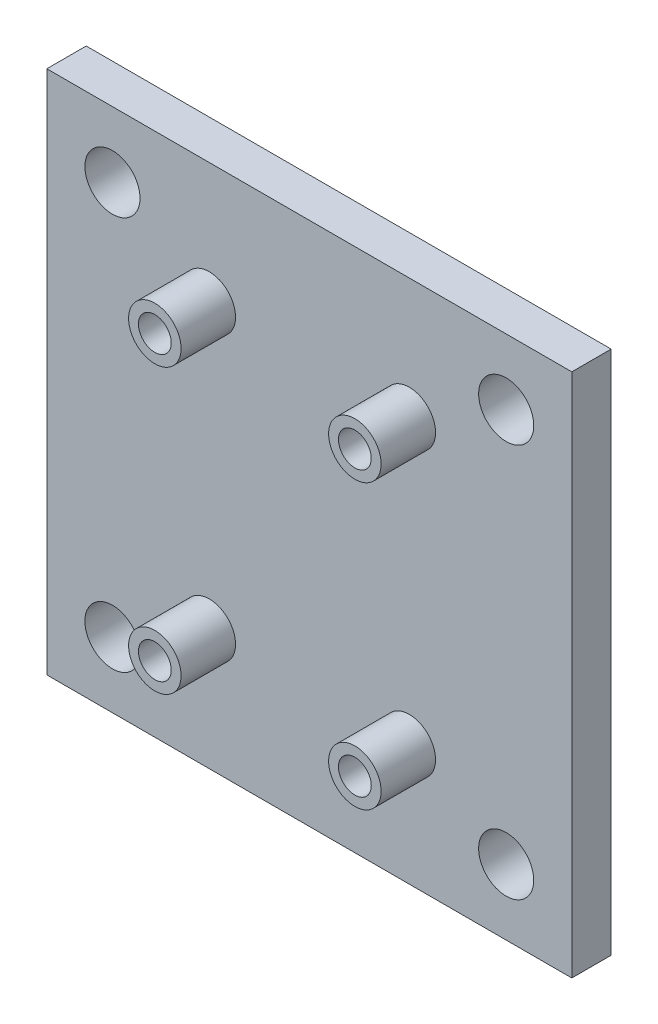
ISO-10303-21;
HEADER;
FILE_DESCRIPTION(('STEP AP214'),'2;1');
FILE_NAME('part.step','',(''),(''),'','','');
FILE_SCHEMA(('AUTOMOTIVE_DESIGN { 1 0 10303 214 1 1 1 1 }'));
ENDSEC;
DATA;
#1=APPLICATION_CONTEXT('core data for automotive mechanical design processes');
#2=APPLICATION_PROTOCOL_DEFINITION('international standard','automotive_design',2000,#1);
#3=PRODUCT_CONTEXT('',#1,'mechanical');
#4=PRODUCT('Part','Part','',(#3));
#5=PRODUCT_RELATED_PRODUCT_CATEGORY('part','',(#4));
#6=PRODUCT_DEFINITION_FORMATION('','',#4);
#7=PRODUCT_DEFINITION_CONTEXT('part definition',#1,'design');
#8=PRODUCT_DEFINITION('design','',#6,#7);
#9=PRODUCT_DEFINITION_SHAPE('','',#8);
#10=(LENGTH_UNIT() NAMED_UNIT(*) SI_UNIT(.MILLI.,.METRE.));
#11=(NAMED_UNIT(*) PLANE_ANGLE_UNIT() SI_UNIT($,.RADIAN.));
#12=(NAMED_UNIT(*) SI_UNIT($,.STERADIAN.) SOLID_ANGLE_UNIT());
#13=UNCERTAINTY_MEASURE_WITH_UNIT(LENGTH_MEASURE(1.E-05),#10,'distance_accuracy_value','');
#14=(GEOMETRIC_REPRESENTATION_CONTEXT(3) GLOBAL_UNCERTAINTY_ASSIGNED_CONTEXT((#13)) GLOBAL_UNIT_ASSIGNED_CONTEXT((#10,
#11,#12)) REPRESENTATION_CONTEXT('',''));
#15=CARTESIAN_POINT('',(0.,0.,0.));
#16=DIRECTION('',(0.,0.,1.));
#17=DIRECTION('',(1.,0.,0.));
#18=AXIS2_PLACEMENT_3D('',#15,#16,#17);
#19=CARTESIAN_POINT('',(20.,-20.,3.));
#20=DIRECTION('',(-1.,0.,0.));
#21=DIRECTION('',(0.,0.,1.));
#22=AXIS2_PLACEMENT_3D('',#19,#20,#21);
#23=PLANE('',#22);
#24=DIRECTION('',(0.,1.,0.));
#25=VECTOR('',#24,1.);
#26=CARTESIAN_POINT('',(20.,-20.,0.));
#27=LINE('',#26,#25);
#28=CARTESIAN_POINT('',(20.,-20.,0.));
#29=VERTEX_POINT('',#28);
#30=CARTESIAN_POINT('',(20.,20.,0.));
#31=VERTEX_POINT('',#30);
#32=EDGE_CURVE('E104',#29,#31,#27,.T.);
#33=ORIENTED_EDGE('',*,*,#32,.T.);
#34=DIRECTION('',(0.,0.,-1.));
#35=VECTOR('',#34,1.);
#36=CARTESIAN_POINT('',(20.,20.,3.));
#37=LINE('',#36,#35);
#38=CARTESIAN_POINT('',(20.,20.,3.));
#39=VERTEX_POINT('',#38);
#40=EDGE_CURVE('E95',#39,#31,#37,.T.);
#41=ORIENTED_EDGE('',*,*,#40,.F.);
#42=DIRECTION('',(0.,1.,0.));
#43=VECTOR('',#42,1.);
#44=CARTESIAN_POINT('',(20.,-20.,3.));
#45=LINE('',#44,#43);
#46=CARTESIAN_POINT('',(20.,-20.,3.));
#47=VERTEX_POINT('',#46);
#48=EDGE_CURVE('E89',#47,#39,#45,.T.);
#49=ORIENTED_EDGE('',*,*,#48,.F.);
#50=DIRECTION('',(0.,0.,-1.));
#51=VECTOR('',#50,1.);
#52=CARTESIAN_POINT('',(20.,-20.,3.));
#53=LINE('',#52,#51);
#54=EDGE_CURVE('E100',#47,#29,#53,.T.);
#55=ORIENTED_EDGE('',*,*,#54,.T.);
#56=EDGE_LOOP('',(#33,#41,#49,#55));
#57=FACE_BOUND('',#56,.T.);
#58=ADVANCED_FACE('F37',(#57),#23,.F.);
#59=CARTESIAN_POINT('',(-20.,20.,3.));
#60=DIRECTION('',(0.,-1.,0.));
#61=DIRECTION('',(0.,0.,-1.));
#62=AXIS2_PLACEMENT_3D('',#59,#60,#61);
#63=PLANE('',#62);
#64=DIRECTION('',(-1.,0.,0.));
#65=VECTOR('',#64,1.);
#66=CARTESIAN_POINT('',(-20.,20.,0.));
#67=LINE('',#66,#65);
#68=CARTESIAN_POINT('',(-20.,20.,0.));
#69=VERTEX_POINT('',#68);
#70=EDGE_CURVE('E94',#31,#69,#67,.T.);
#71=ORIENTED_EDGE('',*,*,#70,.T.);
#72=DIRECTION('',(0.,0.,-1.));
#73=VECTOR('',#72,1.);
#74=CARTESIAN_POINT('',(-20.,20.,3.));
#75=LINE('',#74,#73);
#76=CARTESIAN_POINT('',(-20.,20.,3.));
#77=VERTEX_POINT('',#76);
#78=EDGE_CURVE('E92',#77,#69,#75,.T.);
#79=ORIENTED_EDGE('',*,*,#78,.F.);
#80=DIRECTION('',(-1.,0.,0.));
#81=VECTOR('',#80,1.);
#82=CARTESIAN_POINT('',(-20.,20.,3.));
#83=LINE('',#82,#81);
#84=EDGE_CURVE('E84',#39,#77,#83,.T.);
#85=ORIENTED_EDGE('',*,*,#84,.F.);
#86=ORIENTED_EDGE('',*,*,#40,.T.);
#87=EDGE_LOOP('',(#71,#79,#85,#86));
#88=FACE_BOUND('',#87,.T.);
#89=ADVANCED_FACE('F93',(#88),#63,.F.);
#90=CARTESIAN_POINT('',(-20.,-20.,3.));
#91=DIRECTION('',(1.,0.,0.));
#92=DIRECTION('',(0.,0.,-1.));
#93=AXIS2_PLACEMENT_3D('',#90,#91,#92);
#94=PLANE('',#93);
#95=DIRECTION('',(0.,-1.,0.));
#96=VECTOR('',#95,1.);
#97=CARTESIAN_POINT('',(-20.,-20.,0.));
#98=LINE('',#97,#96);
#99=CARTESIAN_POINT('',(-20.,-20.,0.));
#100=VERTEX_POINT('',#99);
#101=EDGE_CURVE('E70',#69,#100,#98,.T.);
#102=ORIENTED_EDGE('',*,*,#101,.T.);
#103=DIRECTION('',(0.,0.,-1.));
#104=VECTOR('',#103,1.);
#105=CARTESIAN_POINT('',(-20.,-20.,3.));
#106=LINE('',#105,#104);
#107=CARTESIAN_POINT('',(-20.,-20.,3.));
#108=VERTEX_POINT('',#107);
#109=EDGE_CURVE('E96',#108,#100,#106,.T.);
#110=ORIENTED_EDGE('',*,*,#109,.F.);
#111=DIRECTION('',(0.,-1.,0.));
#112=VECTOR('',#111,1.);
#113=CARTESIAN_POINT('',(-20.,-20.,3.));
#114=LINE('',#113,#112);
#115=EDGE_CURVE('E87',#77,#108,#114,.T.);
#116=ORIENTED_EDGE('',*,*,#115,.F.);
#117=ORIENTED_EDGE('',*,*,#78,.T.);
#118=EDGE_LOOP('',(#102,#110,#116,#117));
#119=FACE_BOUND('',#118,.T.);
#120=ADVANCED_FACE('F98',(#119),#94,.F.);
#121=CARTESIAN_POINT('',(-20.,-20.,3.));
#122=DIRECTION('',(0.,1.,0.));
#123=DIRECTION('',(0.,0.,1.));
#124=AXIS2_PLACEMENT_3D('',#121,#122,#123);
#125=PLANE('',#124);
#126=DIRECTION('',(1.,0.,0.));
#127=VECTOR('',#126,1.);
#128=CARTESIAN_POINT('',(-20.,-20.,0.));
#129=LINE('',#128,#127);
#130=EDGE_CURVE('E76',#100,#29,#129,.T.);
#131=ORIENTED_EDGE('',*,*,#130,.T.);
#132=ORIENTED_EDGE('',*,*,#54,.F.);
#133=DIRECTION('',(1.,0.,0.));
#134=VECTOR('',#133,1.);
#135=CARTESIAN_POINT('',(-20.,-20.,3.));
#136=LINE('',#135,#134);
#137=EDGE_CURVE('E53',#108,#47,#136,.T.);
#138=ORIENTED_EDGE('',*,*,#137,.F.);
#139=ORIENTED_EDGE('',*,*,#109,.T.);
#140=EDGE_LOOP('',(#131,#132,#138,#139));
#141=FACE_BOUND('',#140,.T.);
#142=ADVANCED_FACE('F127',(#141),#125,.F.);
#143=CARTESIAN_POINT('',(0.,0.,3.));
#144=DIRECTION('',(0.,0.,-1.));
#145=DIRECTION('',(-1.,0.,0.));
#146=AXIS2_PLACEMENT_3D('',#143,#144,#145);
#147=PLANE('',#146);
#148=CARTESIAN_POINT('',(15.,15.,3.));
#149=DIRECTION('',(0.,0.,1.));
#150=DIRECTION('',(-1.,0.,0.));
#151=AXIS2_PLACEMENT_3D('',#148,#149,#150);
#152=CIRCLE('',#151,2.1);
#153=CARTESIAN_POINT('',(12.9,15.,3.));
#154=VERTEX_POINT('',#153);
#155=EDGE_CURVE('E385',#154,#154,#152,.T.);
#156=ORIENTED_EDGE('',*,*,#155,.F.);
#157=EDGE_LOOP('',(#156));
#158=FACE_BOUND('',#157,.T.);
#159=CARTESIAN_POINT('',(15.,-15.,3.));
#160=DIRECTION('',(0.,0.,1.));
#161=DIRECTION('',(1.,0.,0.));
#162=AXIS2_PLACEMENT_3D('',#159,#160,#161);
#163=CIRCLE('',#162,2.1);
#164=CARTESIAN_POINT('',(17.1,-15.,3.));
#165=VERTEX_POINT('',#164);
#166=EDGE_CURVE('E408',#165,#165,#163,.T.);
#167=ORIENTED_EDGE('',*,*,#166,.F.);
#168=EDGE_LOOP('',(#167));
#169=FACE_BOUND('',#168,.T.);
#170=CARTESIAN_POINT('',(-15.,-15.,3.));
#171=DIRECTION('',(0.,0.,1.));
#172=DIRECTION('',(-1.,0.,0.));
#173=AXIS2_PLACEMENT_3D('',#170,#171,#172);
#174=CIRCLE('',#173,2.1);
#175=CARTESIAN_POINT('',(-17.1,-15.,3.));
#176=VERTEX_POINT('',#175);
#177=EDGE_CURVE('E402',#176,#176,#174,.T.);
#178=ORIENTED_EDGE('',*,*,#177,.F.);
#179=EDGE_LOOP('',(#178));
#180=FACE_BOUND('',#179,.T.);
#181=CARTESIAN_POINT('',(-15.,15.,3.));
#182=DIRECTION('',(0.,0.,1.));
#183=DIRECTION('',(1.,0.,0.));
#184=AXIS2_PLACEMENT_3D('',#181,#182,#183);
#185=CIRCLE('',#184,2.1);
#186=CARTESIAN_POINT('',(-12.9,15.,3.));
#187=VERTEX_POINT('',#186);
#188=EDGE_CURVE('E401',#187,#187,#185,.T.);
#189=ORIENTED_EDGE('',*,*,#188,.F.);
#190=EDGE_LOOP('',(#189));
#191=FACE_BOUND('',#190,.T.);
#192=CARTESIAN_POINT('',(7.61999999999999,10.795,3.));
#193=DIRECTION('',(0.,0.,-1.));
#194=DIRECTION('',(-1.,0.,0.));
#195=AXIS2_PLACEMENT_3D('',#192,#193,#194);
#196=CIRCLE('',#195,2.);
#197=CARTESIAN_POINT('',(5.61999999999999,10.795,3.));
#198=VERTEX_POINT('',#197);
#199=EDGE_CURVE('E11',#198,#198,#196,.F.);
#200=ORIENTED_EDGE('',*,*,#199,.F.);
#201=EDGE_LOOP('',(#200));
#202=FACE_BOUND('',#201,.T.);
#203=CARTESIAN_POINT('',(7.61999999999999,-10.795,3.));
#204=DIRECTION('',(0.,0.,-1.));
#205=DIRECTION('',(-1.,0.,0.));
#206=AXIS2_PLACEMENT_3D('',#203,#204,#205);
#207=CIRCLE('',#206,2.);
#208=CARTESIAN_POINT('',(5.61999999999999,-10.795,3.));
#209=VERTEX_POINT('',#208);
#210=EDGE_CURVE('E45',#209,#209,#207,.F.);
#211=ORIENTED_EDGE('',*,*,#210,.F.);
#212=EDGE_LOOP('',(#211));
#213=FACE_BOUND('',#212,.T.);
#214=CARTESIAN_POINT('',(-7.62,-10.795,3.));
#215=DIRECTION('',(0.,0.,-1.));
#216=DIRECTION('',(-1.,0.,0.));
#217=AXIS2_PLACEMENT_3D('',#214,#215,#216);
#218=CIRCLE('',#217,2.);
#219=CARTESIAN_POINT('',(-9.62,-10.795,3.));
#220=VERTEX_POINT('',#219);
#221=EDGE_CURVE('E117',#220,#220,#218,.F.);
#222=ORIENTED_EDGE('',*,*,#221,.F.);
#223=EDGE_LOOP('',(#222));
#224=FACE_BOUND('',#223,.T.);
#225=CARTESIAN_POINT('',(-7.62,10.795,3.));
#226=DIRECTION('',(0.,0.,-1.));
#227=DIRECTION('',(-1.,0.,0.));
#228=AXIS2_PLACEMENT_3D('',#225,#226,#227);
#229=CIRCLE('',#228,2.);
#230=CARTESIAN_POINT('',(-9.62,10.795,3.));
#231=VERTEX_POINT('',#230);
#232=EDGE_CURVE('E114',#231,#231,#229,.F.);
#233=ORIENTED_EDGE('',*,*,#232,.F.);
#234=EDGE_LOOP('',(#233));
#235=FACE_BOUND('',#234,.T.);
#236=ORIENTED_EDGE('',*,*,#48,.T.);
#237=ORIENTED_EDGE('',*,*,#84,.T.);
#238=ORIENTED_EDGE('',*,*,#115,.T.);
#239=ORIENTED_EDGE('',*,*,#137,.T.);
#240=EDGE_LOOP('',(#236,#237,#238,#239));
#241=FACE_BOUND('',#240,.T.);
#242=ADVANCED_FACE('F85',(#158,#169,#180,#191,#202,#213,#224,#235,#241),#147,.F.);
#243=CARTESIAN_POINT('',(0.,0.,0.));
#244=DIRECTION('',(0.,0.,-1.));
#245=DIRECTION('',(-1.,0.,0.));
#246=AXIS2_PLACEMENT_3D('',#243,#244,#245);
#247=PLANE('',#246);
#248=CARTESIAN_POINT('',(15.,15.,0.));
#249=DIRECTION('',(0.,0.,1.));
#250=DIRECTION('',(-1.,0.,0.));
#251=AXIS2_PLACEMENT_3D('',#248,#249,#250);
#252=CIRCLE('',#251,2.1);
#253=CARTESIAN_POINT('',(12.9,15.,0.));
#254=VERTEX_POINT('',#253);
#255=EDGE_CURVE('E389',#254,#254,#252,.T.);
#256=ORIENTED_EDGE('',*,*,#255,.T.);
#257=EDGE_LOOP('',(#256));
#258=FACE_BOUND('',#257,.T.);
#259=CARTESIAN_POINT('',(15.,-15.,0.));
#260=DIRECTION('',(0.,0.,1.));
#261=DIRECTION('',(1.,0.,0.));
#262=AXIS2_PLACEMENT_3D('',#259,#260,#261);
#263=CIRCLE('',#262,2.1);
#264=CARTESIAN_POINT('',(17.1,-15.,0.));
#265=VERTEX_POINT('',#264);
#266=EDGE_CURVE('E405',#265,#265,#263,.T.);
#267=ORIENTED_EDGE('',*,*,#266,.T.);
#268=EDGE_LOOP('',(#267));
#269=FACE_BOUND('',#268,.T.);
#270=CARTESIAN_POINT('',(-15.,-15.,0.));
#271=DIRECTION('',(0.,0.,1.));
#272=DIRECTION('',(-1.,0.,0.));
#273=AXIS2_PLACEMENT_3D('',#270,#271,#272);
#274=CIRCLE('',#273,2.1);
#275=CARTESIAN_POINT('',(-17.1,-15.,0.));
#276=VERTEX_POINT('',#275);
#277=EDGE_CURVE('E398',#276,#276,#274,.T.);
#278=ORIENTED_EDGE('',*,*,#277,.T.);
#279=EDGE_LOOP('',(#278));
#280=FACE_BOUND('',#279,.T.);
#281=CARTESIAN_POINT('',(-15.,15.,0.));
#282=DIRECTION('',(0.,0.,1.));
#283=DIRECTION('',(1.,0.,0.));
#284=AXIS2_PLACEMENT_3D('',#281,#282,#283);
#285=CIRCLE('',#284,2.1);
#286=CARTESIAN_POINT('',(-12.9,15.,0.));
#287=VERTEX_POINT('',#286);
#288=EDGE_CURVE('E413',#287,#287,#285,.T.);
#289=ORIENTED_EDGE('',*,*,#288,.T.);
#290=EDGE_LOOP('',(#289));
#291=FACE_BOUND('',#290,.T.);
#292=ORIENTED_EDGE('',*,*,#32,.F.);
#293=ORIENTED_EDGE('',*,*,#130,.F.);
#294=ORIENTED_EDGE('',*,*,#101,.F.);
#295=ORIENTED_EDGE('',*,*,#70,.F.);
#296=EDGE_LOOP('',(#292,#293,#294,#295));
#297=FACE_BOUND('',#296,.T.);
#298=ADVANCED_FACE('F126',(#258,#269,#280,#291,#297),#247,.T.);
#299=CARTESIAN_POINT('',(-7.62,10.795,7.15));
#300=DIRECTION('',(0.,0.,-1.));
#301=DIRECTION('',(-1.,0.,0.));
#302=AXIS2_PLACEMENT_3D('',#299,#300,#301);
#303=CYLINDRICAL_SURFACE('',#302,2.);
#304=CARTESIAN_POINT('',(-7.62,10.795,7.15));
#305=DIRECTION('',(0.,0.,1.));
#306=DIRECTION('',(1.,0.,0.));
#307=AXIS2_PLACEMENT_3D('',#304,#305,#306);
#308=CIRCLE('',#307,2.);
#309=CARTESIAN_POINT('',(-5.62,10.795,7.15));
#310=VERTEX_POINT('',#309);
#311=EDGE_CURVE('E107',#310,#310,#308,.T.);
#312=ORIENTED_EDGE('',*,*,#311,.F.);
#313=EDGE_LOOP('',(#312));
#314=FACE_BOUND('',#313,.T.);
#315=ORIENTED_EDGE('',*,*,#232,.T.);
#316=EDGE_LOOP('',(#315));
#317=FACE_BOUND('',#316,.T.);
#318=ADVANCED_FACE('F134',(#314,#317),#303,.T.);
#319=CARTESIAN_POINT('',(-7.62,10.795,7.15));
#320=DIRECTION('',(0.,0.,1.));
#321=DIRECTION('',(1.,0.,0.));
#322=AXIS2_PLACEMENT_3D('',#319,#320,#321);
#323=PLANE('',#322);
#324=CARTESIAN_POINT('',(-7.62,10.795,7.15));
#325=DIRECTION('',(0.,0.,1.));
#326=DIRECTION('',(1.,0.,0.));
#327=AXIS2_PLACEMENT_3D('',#324,#325,#326);
#328=CIRCLE('',#327,1.25);
#329=CARTESIAN_POINT('',(-6.37,10.795,7.15));
#330=VERTEX_POINT('',#329);
#331=EDGE_CURVE('E386',#330,#330,#328,.T.);
#332=ORIENTED_EDGE('',*,*,#331,.F.);
#333=EDGE_LOOP('',(#332));
#334=FACE_BOUND('',#333,.T.);
#335=ORIENTED_EDGE('',*,*,#311,.T.);
#336=EDGE_LOOP('',(#335));
#337=FACE_BOUND('',#336,.T.);
#338=ADVANCED_FACE('F136',(#334,#337),#323,.T.);
#339=CARTESIAN_POINT('',(-7.62,-10.795,7.15));
#340=DIRECTION('',(0.,0.,-1.));
#341=DIRECTION('',(-1.,0.,0.));
#342=AXIS2_PLACEMENT_3D('',#339,#340,#341);
#343=CYLINDRICAL_SURFACE('',#342,2.);
#344=CARTESIAN_POINT('',(-7.62,-10.795,7.15));
#345=DIRECTION('',(0.,0.,1.));
#346=DIRECTION('',(-1.,0.,0.));
#347=AXIS2_PLACEMENT_3D('',#344,#345,#346);
#348=CIRCLE('',#347,2.);
#349=CARTESIAN_POINT('',(-9.62,-10.795,7.15));
#350=VERTEX_POINT('',#349);
#351=EDGE_CURVE('E424',#350,#350,#348,.T.);
#352=ORIENTED_EDGE('',*,*,#351,.F.);
#353=EDGE_LOOP('',(#352));
#354=FACE_BOUND('',#353,.T.);
#355=ORIENTED_EDGE('',*,*,#221,.T.);
#356=EDGE_LOOP('',(#355));
#357=FACE_BOUND('',#356,.T.);
#358=ADVANCED_FACE('F143',(#354,#357),#343,.T.);
#359=CARTESIAN_POINT('',(-7.62,-10.795,7.15));
#360=DIRECTION('',(0.,0.,-1.));
#361=DIRECTION('',(-1.,0.,0.));
#362=AXIS2_PLACEMENT_3D('',#359,#360,#361);
#363=PLANE('',#362);
#364=CARTESIAN_POINT('',(-7.62,-10.795,7.15));
#365=DIRECTION('',(0.,0.,1.));
#366=DIRECTION('',(-1.,0.,0.));
#367=AXIS2_PLACEMENT_3D('',#364,#365,#366);
#368=CIRCLE('',#367,1.25);
#369=CARTESIAN_POINT('',(-8.87,-10.795,7.15));
#370=VERTEX_POINT('',#369);
#371=EDGE_CURVE('E467',#370,#370,#368,.T.);
#372=ORIENTED_EDGE('',*,*,#371,.F.);
#373=EDGE_LOOP('',(#372));
#374=FACE_BOUND('',#373,.T.);
#375=ORIENTED_EDGE('',*,*,#351,.T.);
#376=EDGE_LOOP('',(#375));
#377=FACE_BOUND('',#376,.T.);
#378=ADVANCED_FACE('F213',(#374,#377),#363,.F.);
#379=CARTESIAN_POINT('',(7.61999999999999,-10.795,7.15));
#380=DIRECTION('',(0.,0.,-1.));
#381=DIRECTION('',(-1.,0.,0.));
#382=AXIS2_PLACEMENT_3D('',#379,#380,#381);
#383=CYLINDRICAL_SURFACE('',#382,2.);
#384=CARTESIAN_POINT('',(7.61999999999999,-10.795,7.15));
#385=DIRECTION('',(0.,0.,1.));
#386=DIRECTION('',(1.,0.,0.));
#387=AXIS2_PLACEMENT_3D('',#384,#385,#386);
#388=CIRCLE('',#387,2.);
#389=CARTESIAN_POINT('',(9.61999999999999,-10.795,7.15));
#390=VERTEX_POINT('',#389);
#391=EDGE_CURVE('E421',#390,#390,#388,.T.);
#392=ORIENTED_EDGE('',*,*,#391,.F.);
#393=EDGE_LOOP('',(#392));
#394=FACE_BOUND('',#393,.T.);
#395=ORIENTED_EDGE('',*,*,#210,.T.);
#396=EDGE_LOOP('',(#395));
#397=FACE_BOUND('',#396,.T.);
#398=ADVANCED_FACE('F122',(#394,#397),#383,.T.);
#399=CARTESIAN_POINT('',(7.61999999999999,-10.795,7.15));
#400=DIRECTION('',(0.,0.,1.));
#401=DIRECTION('',(1.,0.,0.));
#402=AXIS2_PLACEMENT_3D('',#399,#400,#401);
#403=PLANE('',#402);
#404=CARTESIAN_POINT('',(7.62,-10.795,7.15));
#405=DIRECTION('',(0.,0.,1.));
#406=DIRECTION('',(1.,0.,0.));
#407=AXIS2_PLACEMENT_3D('',#404,#405,#406);
#408=CIRCLE('',#407,1.25);
#409=CARTESIAN_POINT('',(8.87,-10.795,7.15));
#410=VERTEX_POINT('',#409);
#411=EDGE_CURVE('E461',#410,#410,#408,.T.);
#412=ORIENTED_EDGE('',*,*,#411,.F.);
#413=EDGE_LOOP('',(#412));
#414=FACE_BOUND('',#413,.T.);
#415=ORIENTED_EDGE('',*,*,#391,.T.);
#416=EDGE_LOOP('',(#415));
#417=FACE_BOUND('',#416,.T.);
#418=ADVANCED_FACE('F230',(#414,#417),#403,.T.);
#419=CARTESIAN_POINT('',(7.61999999999999,10.795,7.15));
#420=DIRECTION('',(0.,0.,-1.));
#421=DIRECTION('',(-1.,0.,0.));
#422=AXIS2_PLACEMENT_3D('',#419,#420,#421);
#423=CYLINDRICAL_SURFACE('',#422,2.);
#424=CARTESIAN_POINT('',(7.61999999999999,10.795,7.15));
#425=DIRECTION('',(0.,0.,1.));
#426=DIRECTION('',(-1.,0.,0.));
#427=AXIS2_PLACEMENT_3D('',#424,#425,#426);
#428=CIRCLE('',#427,2.);
#429=CARTESIAN_POINT('',(5.61999999999999,10.795,7.15));
#430=VERTEX_POINT('',#429);
#431=EDGE_CURVE('E416',#430,#430,#428,.T.);
#432=ORIENTED_EDGE('',*,*,#431,.F.);
#433=EDGE_LOOP('',(#432));
#434=FACE_BOUND('',#433,.T.);
#435=ORIENTED_EDGE('',*,*,#199,.T.);
#436=EDGE_LOOP('',(#435));
#437=FACE_BOUND('',#436,.T.);
#438=ADVANCED_FACE('F238',(#434,#437),#423,.T.);
#439=CARTESIAN_POINT('',(7.61999999999999,10.795,7.15));
#440=DIRECTION('',(0.,0.,-1.));
#441=DIRECTION('',(-1.,0.,0.));
#442=AXIS2_PLACEMENT_3D('',#439,#440,#441);
#443=PLANE('',#442);
#444=CARTESIAN_POINT('',(7.62,10.795,7.15));
#445=DIRECTION('',(0.,0.,1.));
#446=DIRECTION('',(-1.,0.,0.));
#447=AXIS2_PLACEMENT_3D('',#444,#445,#446);
#448=CIRCLE('',#447,1.25);
#449=CARTESIAN_POINT('',(6.37,10.795,7.15));
#450=VERTEX_POINT('',#449);
#451=EDGE_CURVE('E395',#450,#450,#448,.T.);
#452=ORIENTED_EDGE('',*,*,#451,.F.);
#453=EDGE_LOOP('',(#452));
#454=FACE_BOUND('',#453,.T.);
#455=ORIENTED_EDGE('',*,*,#431,.T.);
#456=EDGE_LOOP('',(#455));
#457=FACE_BOUND('',#456,.T.);
#458=ADVANCED_FACE('F247',(#454,#457),#443,.F.);
#459=CARTESIAN_POINT('',(-15.,15.,0.));
#460=DIRECTION('',(0.,0.,1.));
#461=DIRECTION('',(1.,0.,0.));
#462=AXIS2_PLACEMENT_3D('',#459,#460,#461);
#463=CYLINDRICAL_SURFACE('',#462,2.1);
#464=ORIENTED_EDGE('',*,*,#288,.F.);
#465=EDGE_LOOP('',(#464));
#466=FACE_BOUND('',#465,.T.);
#467=ORIENTED_EDGE('',*,*,#188,.T.);
#468=EDGE_LOOP('',(#467));
#469=FACE_BOUND('',#468,.T.);
#470=ADVANCED_FACE('F255',(#466,#469),#463,.F.);
#471=CARTESIAN_POINT('',(-15.,-15.,0.));
#472=DIRECTION('',(0.,0.,1.));
#473=DIRECTION('',(1.,0.,0.));
#474=AXIS2_PLACEMENT_3D('',#471,#472,#473);
#475=CYLINDRICAL_SURFACE('',#474,2.1);
#476=ORIENTED_EDGE('',*,*,#277,.F.);
#477=EDGE_LOOP('',(#476));
#478=FACE_BOUND('',#477,.T.);
#479=ORIENTED_EDGE('',*,*,#177,.T.);
#480=EDGE_LOOP('',(#479));
#481=FACE_BOUND('',#480,.T.);
#482=ADVANCED_FACE('F264',(#478,#481),#475,.F.);
#483=CARTESIAN_POINT('',(15.,-15.,0.));
#484=DIRECTION('',(0.,0.,1.));
#485=DIRECTION('',(1.,0.,0.));
#486=AXIS2_PLACEMENT_3D('',#483,#484,#485);
#487=CYLINDRICAL_SURFACE('',#486,2.1);
#488=ORIENTED_EDGE('',*,*,#266,.F.);
#489=EDGE_LOOP('',(#488));
#490=FACE_BOUND('',#489,.T.);
#491=ORIENTED_EDGE('',*,*,#166,.T.);
#492=EDGE_LOOP('',(#491));
#493=FACE_BOUND('',#492,.T.);
#494=ADVANCED_FACE('F273',(#490,#493),#487,.F.);
#495=CARTESIAN_POINT('',(15.,15.,0.));
#496=DIRECTION('',(0.,0.,1.));
#497=DIRECTION('',(1.,0.,0.));
#498=AXIS2_PLACEMENT_3D('',#495,#496,#497);
#499=CYLINDRICAL_SURFACE('',#498,2.1);
#500=ORIENTED_EDGE('',*,*,#255,.F.);
#501=EDGE_LOOP('',(#500));
#502=FACE_BOUND('',#501,.T.);
#503=ORIENTED_EDGE('',*,*,#155,.T.);
#504=EDGE_LOOP('',(#503));
#505=FACE_BOUND('',#504,.T.);
#506=ADVANCED_FACE('F282',(#502,#505),#499,.F.);
#507=CARTESIAN_POINT('',(7.62,10.795,3.));
#508=DIRECTION('',(0.,0.,1.));
#509=DIRECTION('',(1.,0.,0.));
#510=AXIS2_PLACEMENT_3D('',#507,#508,#509);
#511=CYLINDRICAL_SURFACE('',#510,1.25);
#512=CARTESIAN_POINT('',(7.62,10.795,3.));
#513=DIRECTION('',(0.,0.,1.));
#514=DIRECTION('',(-1.,0.,0.));
#515=AXIS2_PLACEMENT_3D('',#512,#513,#514);
#516=CIRCLE('',#515,1.25);
#517=CARTESIAN_POINT('',(6.37,10.795,3.));
#518=VERTEX_POINT('',#517);
#519=EDGE_CURVE('E458',#518,#518,#516,.T.);
#520=ORIENTED_EDGE('',*,*,#519,.F.);
#521=EDGE_LOOP('',(#520));
#522=FACE_BOUND('',#521,.T.);
#523=ORIENTED_EDGE('',*,*,#451,.T.);
#524=EDGE_LOOP('',(#523));
#525=FACE_BOUND('',#524,.T.);
#526=ADVANCED_FACE('F290',(#522,#525),#511,.F.);
#527=CARTESIAN_POINT('',(7.62,10.795,3.));
#528=DIRECTION('',(0.,0.,-1.));
#529=DIRECTION('',(-1.,0.,0.));
#530=AXIS2_PLACEMENT_3D('',#527,#528,#529);
#531=PLANE('',#530);
#532=ORIENTED_EDGE('',*,*,#519,.T.);
#533=EDGE_LOOP('',(#532));
#534=FACE_BOUND('',#533,.T.);
#535=ADVANCED_FACE('F298',(#534),#531,.F.);
#536=CARTESIAN_POINT('',(7.62,-10.795,3.));
#537=DIRECTION('',(0.,0.,1.));
#538=DIRECTION('',(1.,0.,0.));
#539=AXIS2_PLACEMENT_3D('',#536,#537,#538);
#540=CYLINDRICAL_SURFACE('',#539,1.25);
#541=CARTESIAN_POINT('',(7.62,-10.795,3.));
#542=DIRECTION('',(0.,0.,1.));
#543=DIRECTION('',(1.,0.,0.));
#544=AXIS2_PLACEMENT_3D('',#541,#542,#543);
#545=CIRCLE('',#544,1.25);
#546=CARTESIAN_POINT('',(8.87,-10.795,3.));
#547=VERTEX_POINT('',#546);
#548=EDGE_CURVE('E464',#547,#547,#545,.T.);
#549=ORIENTED_EDGE('',*,*,#548,.F.);
#550=EDGE_LOOP('',(#549));
#551=FACE_BOUND('',#550,.T.);
#552=ORIENTED_EDGE('',*,*,#411,.T.);
#553=EDGE_LOOP('',(#552));
#554=FACE_BOUND('',#553,.T.);
#555=ADVANCED_FACE('F307',(#551,#554),#540,.F.);
#556=CARTESIAN_POINT('',(7.62,-10.795,3.));
#557=DIRECTION('',(0.,0.,1.));
#558=DIRECTION('',(1.,0.,0.));
#559=AXIS2_PLACEMENT_3D('',#556,#557,#558);
#560=PLANE('',#559);
#561=ORIENTED_EDGE('',*,*,#548,.T.);
#562=EDGE_LOOP('',(#561));
#563=FACE_BOUND('',#562,.T.);
#564=ADVANCED_FACE('F316',(#563),#560,.T.);
#565=CARTESIAN_POINT('',(-7.62,-10.795,3.));
#566=DIRECTION('',(0.,0.,1.));
#567=DIRECTION('',(1.,0.,0.));
#568=AXIS2_PLACEMENT_3D('',#565,#566,#567);
#569=CYLINDRICAL_SURFACE('',#568,1.25);
#570=CARTESIAN_POINT('',(-7.62,-10.795,3.));
#571=DIRECTION('',(0.,0.,1.));
#572=DIRECTION('',(-1.,0.,0.));
#573=AXIS2_PLACEMENT_3D('',#570,#571,#572);
#574=CIRCLE('',#573,1.25);
#575=CARTESIAN_POINT('',(-8.87,-10.795,3.));
#576=VERTEX_POINT('',#575);
#577=EDGE_CURVE('E392',#576,#576,#574,.T.);
#578=ORIENTED_EDGE('',*,*,#577,.F.);
#579=EDGE_LOOP('',(#578));
#580=FACE_BOUND('',#579,.T.);
#581=ORIENTED_EDGE('',*,*,#371,.T.);
#582=EDGE_LOOP('',(#581));
#583=FACE_BOUND('',#582,.T.);
#584=ADVANCED_FACE('F325',(#580,#583),#569,.F.);
#585=CARTESIAN_POINT('',(-7.62,-10.795,3.));
#586=DIRECTION('',(0.,0.,-1.));
#587=DIRECTION('',(-1.,0.,0.));
#588=AXIS2_PLACEMENT_3D('',#585,#586,#587);
#589=PLANE('',#588);
#590=ORIENTED_EDGE('',*,*,#577,.T.);
#591=EDGE_LOOP('',(#590));
#592=FACE_BOUND('',#591,.T.);
#593=ADVANCED_FACE('F334',(#592),#589,.F.);
#594=CARTESIAN_POINT('',(-7.62,10.795,3.));
#595=DIRECTION('',(0.,0.,1.));
#596=DIRECTION('',(1.,0.,0.));
#597=AXIS2_PLACEMENT_3D('',#594,#595,#596);
#598=CYLINDRICAL_SURFACE('',#597,1.25);
#599=CARTESIAN_POINT('',(-7.62,10.795,3.));
#600=DIRECTION('',(0.,0.,1.));
#601=DIRECTION('',(1.,0.,0.));
#602=AXIS2_PLACEMENT_3D('',#599,#600,#601);
#603=CIRCLE('',#602,1.25);
#604=CARTESIAN_POINT('',(-6.37,10.795,3.));
#605=VERTEX_POINT('',#604);
#606=EDGE_CURVE('E384',#605,#605,#603,.T.);
#607=ORIENTED_EDGE('',*,*,#606,.F.);
#608=EDGE_LOOP('',(#607));
#609=FACE_BOUND('',#608,.T.);
#610=ORIENTED_EDGE('',*,*,#331,.T.);
#611=EDGE_LOOP('',(#610));
#612=FACE_BOUND('',#611,.T.);
#613=ADVANCED_FACE('F343',(#609,#612),#598,.F.);
#614=CARTESIAN_POINT('',(-7.62,10.795,3.));
#615=DIRECTION('',(0.,0.,1.));
#616=DIRECTION('',(1.,0.,0.));
#617=AXIS2_PLACEMENT_3D('',#614,#615,#616);
#618=PLANE('',#617);
#619=ORIENTED_EDGE('',*,*,#606,.T.);
#620=EDGE_LOOP('',(#619));
#621=FACE_BOUND('',#620,.T.);
#622=ADVANCED_FACE('F352',(#621),#618,.T.);
#623=CLOSED_SHELL('',(#58,#89,#120,#142,#242,#298,#318,#338,#358,#378,#398,#418,#438,#458,#470,
#482,#494,#506,#526,#535,#555,#564,#584,#593,#613,#622));
#624=MANIFOLD_SOLID_BREP('B2',#623);
#625=ADVANCED_BREP_SHAPE_REPRESENTATION('',(#18,#624),#14);
#626=SHAPE_DEFINITION_REPRESENTATION(#9,#625);
ENDSEC;
END-ISO-10303-21;
